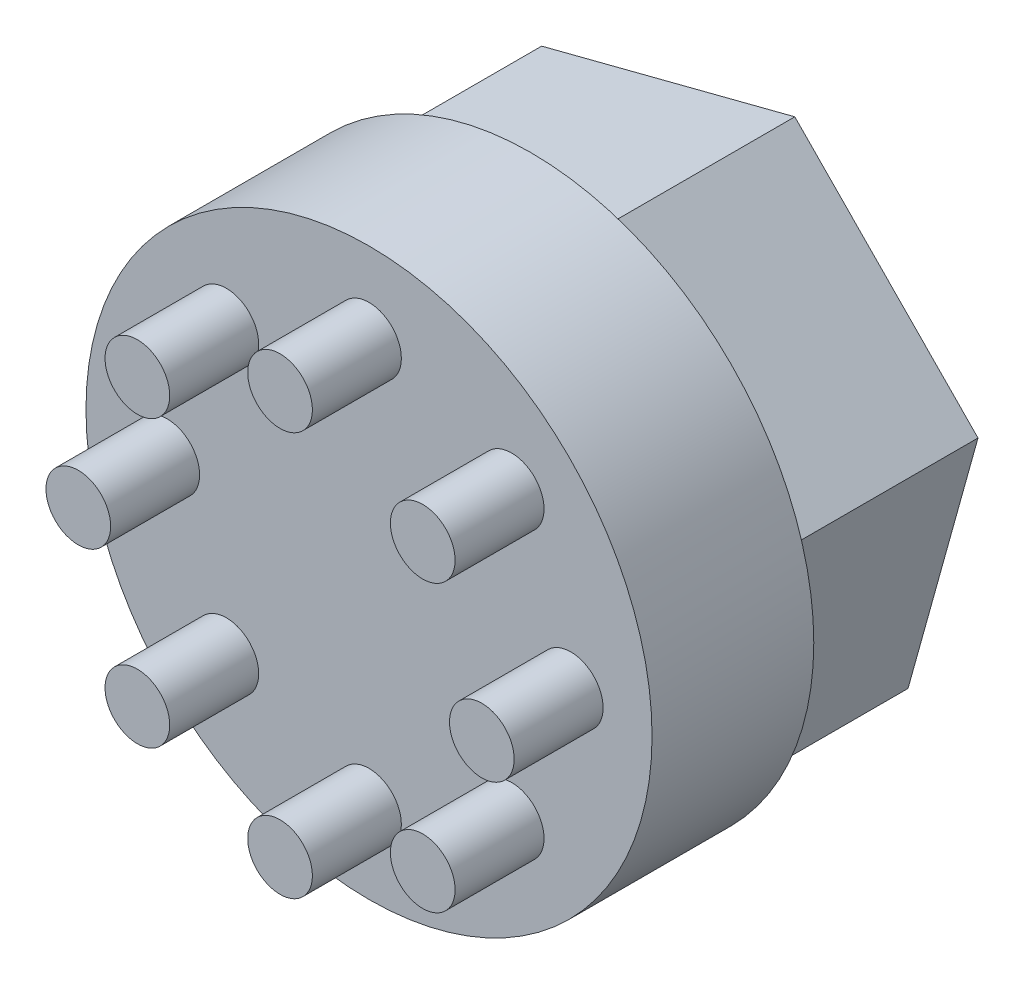
ISO-10303-21;
HEADER;
FILE_DESCRIPTION(('STEP AP214'),'2;1');
FILE_NAME('part.step','',(''),(''),'','','');
FILE_SCHEMA(('AUTOMOTIVE_DESIGN { 1 0 10303 214 1 1 1 1 }'));
ENDSEC;
DATA;
#1=APPLICATION_CONTEXT('core data for automotive mechanical design processes');
#2=APPLICATION_PROTOCOL_DEFINITION('international standard','automotive_design',2000,#1);
#3=PRODUCT_CONTEXT('',#1,'mechanical');
#4=PRODUCT('Part','Part','',(#3));
#5=PRODUCT_RELATED_PRODUCT_CATEGORY('part','',(#4));
#6=PRODUCT_DEFINITION_FORMATION('','',#4);
#7=PRODUCT_DEFINITION_CONTEXT('part definition',#1,'design');
#8=PRODUCT_DEFINITION('design','',#6,#7);
#9=PRODUCT_DEFINITION_SHAPE('','',#8);
#10=(LENGTH_UNIT() NAMED_UNIT(*) SI_UNIT(.MILLI.,.METRE.));
#11=(NAMED_UNIT(*) PLANE_ANGLE_UNIT() SI_UNIT($,.RADIAN.));
#12=(NAMED_UNIT(*) SI_UNIT($,.STERADIAN.) SOLID_ANGLE_UNIT());
#13=UNCERTAINTY_MEASURE_WITH_UNIT(LENGTH_MEASURE(1.E-05),#10,'distance_accuracy_value','');
#14=(GEOMETRIC_REPRESENTATION_CONTEXT(3) GLOBAL_UNCERTAINTY_ASSIGNED_CONTEXT((#13)) GLOBAL_UNIT_ASSIGNED_CONTEXT((#10,
#11,#12)) REPRESENTATION_CONTEXT('',''));
#15=CARTESIAN_POINT('',(0.,0.,0.));
#16=DIRECTION('',(0.,0.,1.));
#17=DIRECTION('',(1.,0.,0.));
#18=AXIS2_PLACEMENT_3D('',#15,#16,#17);
#19=CARTESIAN_POINT('',(0.,0.,0.));
#20=DIRECTION('',(0.,0.,1.));
#21=DIRECTION('',(1.,0.,0.));
#22=AXIS2_PLACEMENT_3D('',#19,#20,#21);
#23=PLANE('',#22);
#24=CARTESIAN_POINT('',(0.,0.,0.));
#25=DIRECTION('',(0.,0.,1.));
#26=DIRECTION('',(1.,0.,0.));
#27=AXIS2_PLACEMENT_3D('',#24,#25,#26);
#28=CIRCLE('',#27,17.5);
#29=CARTESIAN_POINT('',(17.5,0.,0.));
#30=VERTEX_POINT('',#29);
#31=EDGE_CURVE('E37',#30,#30,#28,.T.);
#32=ORIENTED_EDGE('',*,*,#31,.F.);
#33=EDGE_LOOP('',(#32));
#34=FACE_BOUND('',#33,.T.);
#35=DIRECTION('',(0.267671004992273,0.963510369994235,0.));
#36=VECTOR('',#35,1.);
#37=CARTESIAN_POINT('',(-15.6527041549309,-4.04056753087253,0.));
#38=LINE('',#37,#36);
#39=CARTESIAN_POINT('',(-15.6527041549309,-4.04056753087253,0.));
#40=VERTEX_POINT('',#39);
#41=CARTESIAN_POINT('',(-11.3255862049076,11.5353556706562,0.));
#42=VERTEX_POINT('',#41);
#43=EDGE_CURVE('E106',#40,#42,#38,.T.);
#44=ORIENTED_EDGE('',*,*,#43,.F.);
#45=DIRECTION('',(-0.700588954728615,0.713565075176936,0.));
#46=VECTOR('',#45,1.);
#47=CARTESIAN_POINT('',(-4.32711795002329,-15.5759232015287,0.));
#48=LINE('',#47,#46);
#49=CARTESIAN_POINT('',(-4.32711795002329,-15.5759232015287,0.));
#50=VERTEX_POINT('',#49);
#51=EDGE_CURVE('E103',#50,#40,#48,.T.);
#52=ORIENTED_EDGE('',*,*,#51,.F.);
#53=DIRECTION('',(-0.968259959720887,-0.249945294817298,0.));
#54=VECTOR('',#53,1.);
#55=CARTESIAN_POINT('',(11.3255862049076,-11.5353556706562,0.));
#56=LINE('',#55,#54);
#57=CARTESIAN_POINT('',(11.3255862049076,-11.5353556706562,0.));
#58=VERTEX_POINT('',#57);
#59=EDGE_CURVE('E185',#58,#50,#56,.T.);
#60=ORIENTED_EDGE('',*,*,#59,.F.);
#61=DIRECTION('',(-0.267671004992272,-0.963510369994235,0.));
#62=VECTOR('',#61,1.);
#63=CARTESIAN_POINT('',(15.6527041549309,4.04056753087254,0.));
#64=LINE('',#63,#62);
#65=CARTESIAN_POINT('',(15.6527041549309,4.04056753087254,0.));
#66=VERTEX_POINT('',#65);
#67=EDGE_CURVE('E202',#66,#58,#64,.T.);
#68=ORIENTED_EDGE('',*,*,#67,.F.);
#69=DIRECTION('',(0.700588954728615,-0.713565075176936,0.));
#70=VECTOR('',#69,1.);
#71=CARTESIAN_POINT('',(4.32711795002329,15.5759232015287,0.));
#72=LINE('',#71,#70);
#73=CARTESIAN_POINT('',(4.32711795002329,15.5759232015287,0.));
#74=VERTEX_POINT('',#73);
#75=EDGE_CURVE('E53',#74,#66,#72,.T.);
#76=ORIENTED_EDGE('',*,*,#75,.F.);
#77=DIRECTION('',(0.968259959720887,0.249945294817298,0.));
#78=VECTOR('',#77,1.);
#79=CARTESIAN_POINT('',(-11.3255862049076,11.5353556706562,0.));
#80=LINE('',#79,#78);
#81=EDGE_CURVE('E48',#42,#74,#80,.T.);
#82=ORIENTED_EDGE('',*,*,#81,.F.);
#83=EDGE_LOOP('',(#44,#52,#60,#68,#76,#82));
#84=FACE_BOUND('',#83,.T.);
#85=ADVANCED_FACE('F33',(#34,#84),#23,.F.);
#86=CARTESIAN_POINT('',(0.,0.,10.));
#87=DIRECTION('',(0.,0.,-1.));
#88=DIRECTION('',(-1.,0.,0.));
#89=AXIS2_PLACEMENT_3D('',#86,#87,#88);
#90=CYLINDRICAL_SURFACE('',#89,17.5);
#91=CARTESIAN_POINT('',(0.,0.,10.));
#92=DIRECTION('',(0.,0.,1.));
#93=DIRECTION('',(1.,0.,0.));
#94=AXIS2_PLACEMENT_3D('',#91,#92,#93);
#95=CIRCLE('',#94,17.5);
#96=CARTESIAN_POINT('',(17.5,0.,10.));
#97=VERTEX_POINT('',#96);
#98=EDGE_CURVE('E11',#97,#97,#95,.T.);
#99=ORIENTED_EDGE('',*,*,#98,.F.);
#100=EDGE_LOOP('',(#99));
#101=FACE_BOUND('',#100,.T.);
#102=ORIENTED_EDGE('',*,*,#31,.T.);
#103=EDGE_LOOP('',(#102));
#104=FACE_BOUND('',#103,.T.);
#105=ADVANCED_FACE('F35',(#101,#104),#90,.T.);
#106=CARTESIAN_POINT('',(0.,0.,10.));
#107=DIRECTION('',(0.,0.,1.));
#108=DIRECTION('',(1.,0.,0.));
#109=AXIS2_PLACEMENT_3D('',#106,#107,#108);
#110=PLANE('',#109);
#111=CARTESIAN_POINT('',(-8.82115709530209,8.82115709530196,10.));
#112=DIRECTION('',(0.,0.,1.));
#113=DIRECTION('',(1.,0.,0.));
#114=AXIS2_PLACEMENT_3D('',#111,#112,#113);
#115=CIRCLE('',#114,2.);
#116=CARTESIAN_POINT('',(-6.82115709530209,8.82115709530196,10.));
#117=VERTEX_POINT('',#116);
#118=EDGE_CURVE('E107',#117,#117,#115,.T.);
#119=ORIENTED_EDGE('',*,*,#118,.F.);
#120=EDGE_LOOP('',(#119));
#121=FACE_BOUND('',#120,.T.);
#122=CARTESIAN_POINT('',(-12.4749999999997,-3.10857854469547E-13,10.));
#123=DIRECTION('',(0.,0.,1.));
#124=DIRECTION('',(1.,0.,0.));
#125=AXIS2_PLACEMENT_3D('',#122,#123,#124);
#126=CIRCLE('',#125,2.);
#127=CARTESIAN_POINT('',(-10.4749999999997,-3.10857854469547E-13,10.));
#128=VERTEX_POINT('',#127);
#129=EDGE_CURVE('E117',#128,#128,#126,.T.);
#130=ORIENTED_EDGE('',*,*,#129,.F.);
#131=EDGE_LOOP('',(#130));
#132=FACE_BOUND('',#131,.T.);
#133=CARTESIAN_POINT('',(-8.82115709530165,-8.8211570953024,10.));
#134=DIRECTION('',(0.,0.,1.));
#135=DIRECTION('',(1.,0.,0.));
#136=AXIS2_PLACEMENT_3D('',#133,#134,#135);
#137=CIRCLE('',#136,2.);
#138=CARTESIAN_POINT('',(-6.82115709530165,-8.8211570953024,10.));
#139=VERTEX_POINT('',#138);
#140=EDGE_CURVE('E122',#139,#139,#137,.T.);
#141=ORIENTED_EDGE('',*,*,#140,.F.);
#142=EDGE_LOOP('',(#141));
#143=FACE_BOUND('',#142,.T.);
#144=CARTESIAN_POINT('',(6.18660215175221E-13,-12.475,10.));
#145=DIRECTION('',(0.,0.,1.));
#146=DIRECTION('',(1.,0.,0.));
#147=AXIS2_PLACEMENT_3D('',#144,#145,#146);
#148=CIRCLE('',#147,2.);
#149=CARTESIAN_POINT('',(2.00000000000062,-12.475,10.));
#150=VERTEX_POINT('',#149);
#151=EDGE_CURVE('E128',#150,#150,#148,.T.);
#152=ORIENTED_EDGE('',*,*,#151,.F.);
#153=EDGE_LOOP('',(#152));
#154=FACE_BOUND('',#153,.T.);
#155=CARTESIAN_POINT('',(8.82115709530271,-8.82115709530196,10.));
#156=DIRECTION('',(0.,0.,1.));
#157=DIRECTION('',(1.,0.,0.));
#158=AXIS2_PLACEMENT_3D('',#155,#156,#157);
#159=CIRCLE('',#158,2.);
#160=CARTESIAN_POINT('',(10.8211570953027,-8.82115709530196,10.));
#161=VERTEX_POINT('',#160);
#162=EDGE_CURVE('E134',#161,#161,#159,.T.);
#163=ORIENTED_EDGE('',*,*,#162,.F.);
#164=EDGE_LOOP('',(#163));
#165=FACE_BOUND('',#164,.T.);
#166=CARTESIAN_POINT('',(12.4750000000003,3.09330107587611E-13,10.));
#167=DIRECTION('',(0.,0.,1.));
#168=DIRECTION('',(1.,0.,0.));
#169=AXIS2_PLACEMENT_3D('',#166,#167,#168);
#170=CIRCLE('',#169,2.);
#171=CARTESIAN_POINT('',(14.4750000000003,3.09330107587611E-13,10.));
#172=VERTEX_POINT('',#171);
#173=EDGE_CURVE('E140',#172,#172,#170,.T.);
#174=ORIENTED_EDGE('',*,*,#173,.F.);
#175=EDGE_LOOP('',(#174));
#176=FACE_BOUND('',#175,.T.);
#177=CARTESIAN_POINT('',(8.82115709530227,8.8211570953024,10.));
#178=DIRECTION('',(0.,0.,1.));
#179=DIRECTION('',(1.,0.,0.));
#180=AXIS2_PLACEMENT_3D('',#177,#178,#179);
#181=CIRCLE('',#180,2.);
#182=CARTESIAN_POINT('',(10.8211570953023,8.8211570953024,10.));
#183=VERTEX_POINT('',#182);
#184=EDGE_CURVE('E146',#183,#183,#181,.T.);
#185=ORIENTED_EDGE('',*,*,#184,.F.);
#186=EDGE_LOOP('',(#185));
#187=FACE_BOUND('',#186,.T.);
#188=CARTESIAN_POINT('',(0.,12.475,10.));
#189=DIRECTION('',(0.,0.,1.));
#190=DIRECTION('',(1.,0.,0.));
#191=AXIS2_PLACEMENT_3D('',#188,#189,#190);
#192=CIRCLE('',#191,2.);
#193=CARTESIAN_POINT('',(2.,12.475,10.));
#194=VERTEX_POINT('',#193);
#195=EDGE_CURVE('E152',#194,#194,#192,.T.);
#196=ORIENTED_EDGE('',*,*,#195,.F.);
#197=EDGE_LOOP('',(#196));
#198=FACE_BOUND('',#197,.T.);
#199=ORIENTED_EDGE('',*,*,#98,.T.);
#200=EDGE_LOOP('',(#199));
#201=FACE_BOUND('',#200,.T.);
#202=ADVANCED_FACE('F163',(#121,#132,#143,#154,#165,#176,#187,#198,#201),#110,.T.);
#203=CARTESIAN_POINT('',(0.,12.475,15.5));
#204=DIRECTION('',(0.,0.,-1.));
#205=DIRECTION('',(-1.,0.,0.));
#206=AXIS2_PLACEMENT_3D('',#203,#204,#205);
#207=CYLINDRICAL_SURFACE('',#206,2.);
#208=CARTESIAN_POINT('',(0.,12.475,15.5));
#209=DIRECTION('',(0.,0.,1.));
#210=DIRECTION('',(1.,0.,0.));
#211=AXIS2_PLACEMENT_3D('',#208,#209,#210);
#212=CIRCLE('',#211,2.);
#213=CARTESIAN_POINT('',(2.,12.475,15.5));
#214=VERTEX_POINT('',#213);
#215=EDGE_CURVE('E155',#214,#214,#212,.T.);
#216=ORIENTED_EDGE('',*,*,#215,.F.);
#217=EDGE_LOOP('',(#216));
#218=FACE_BOUND('',#217,.T.);
#219=ORIENTED_EDGE('',*,*,#195,.T.);
#220=EDGE_LOOP('',(#219));
#221=FACE_BOUND('',#220,.T.);
#222=ADVANCED_FACE('F161',(#218,#221),#207,.T.);
#223=CARTESIAN_POINT('',(0.,12.475,15.5));
#224=DIRECTION('',(0.,0.,1.));
#225=DIRECTION('',(1.,0.,0.));
#226=AXIS2_PLACEMENT_3D('',#223,#224,#225);
#227=PLANE('',#226);
#228=ORIENTED_EDGE('',*,*,#215,.T.);
#229=EDGE_LOOP('',(#228));
#230=FACE_BOUND('',#229,.T.);
#231=ADVANCED_FACE('F286',(#230),#227,.T.);
#232=CARTESIAN_POINT('',(8.82115709530227,8.8211570953024,15.5));
#233=DIRECTION('',(0.,0.,-1.));
#234=DIRECTION('',(-1.,0.,0.));
#235=AXIS2_PLACEMENT_3D('',#232,#233,#234);
#236=CYLINDRICAL_SURFACE('',#235,2.);
#237=CARTESIAN_POINT('',(8.82115709530227,8.8211570953024,15.5));
#238=DIRECTION('',(0.,0.,1.));
#239=DIRECTION('',(1.,0.,0.));
#240=AXIS2_PLACEMENT_3D('',#237,#238,#239);
#241=CIRCLE('',#240,2.);
#242=CARTESIAN_POINT('',(10.8211570953023,8.8211570953024,15.5));
#243=VERTEX_POINT('',#242);
#244=EDGE_CURVE('E149',#243,#243,#241,.T.);
#245=ORIENTED_EDGE('',*,*,#244,.F.);
#246=EDGE_LOOP('',(#245));
#247=FACE_BOUND('',#246,.T.);
#248=ORIENTED_EDGE('',*,*,#184,.T.);
#249=EDGE_LOOP('',(#248));
#250=FACE_BOUND('',#249,.T.);
#251=ADVANCED_FACE('F282',(#247,#250),#236,.T.);
#252=CARTESIAN_POINT('',(8.82115709530227,8.8211570953024,15.5));
#253=DIRECTION('',(0.,0.,1.));
#254=DIRECTION('',(1.,0.,0.));
#255=AXIS2_PLACEMENT_3D('',#252,#253,#254);
#256=PLANE('',#255);
#257=ORIENTED_EDGE('',*,*,#244,.T.);
#258=EDGE_LOOP('',(#257));
#259=FACE_BOUND('',#258,.T.);
#260=ADVANCED_FACE('F278',(#259),#256,.T.);
#261=CARTESIAN_POINT('',(12.4750000000003,3.09330107587611E-13,15.5));
#262=DIRECTION('',(0.,0.,-1.));
#263=DIRECTION('',(-1.,0.,0.));
#264=AXIS2_PLACEMENT_3D('',#261,#262,#263);
#265=CYLINDRICAL_SURFACE('',#264,2.);
#266=CARTESIAN_POINT('',(12.4750000000003,3.09330107587611E-13,15.5));
#267=DIRECTION('',(0.,0.,1.));
#268=DIRECTION('',(1.,0.,0.));
#269=AXIS2_PLACEMENT_3D('',#266,#267,#268);
#270=CIRCLE('',#269,2.);
#271=CARTESIAN_POINT('',(14.4750000000003,3.09330107587611E-13,15.5));
#272=VERTEX_POINT('',#271);
#273=EDGE_CURVE('E143',#272,#272,#270,.T.);
#274=ORIENTED_EDGE('',*,*,#273,.F.);
#275=EDGE_LOOP('',(#274));
#276=FACE_BOUND('',#275,.T.);
#277=ORIENTED_EDGE('',*,*,#173,.T.);
#278=EDGE_LOOP('',(#277));
#279=FACE_BOUND('',#278,.T.);
#280=ADVANCED_FACE('F274',(#276,#279),#265,.T.);
#281=CARTESIAN_POINT('',(12.4750000000003,3.09330107587611E-13,15.5));
#282=DIRECTION('',(0.,0.,1.));
#283=DIRECTION('',(1.,0.,0.));
#284=AXIS2_PLACEMENT_3D('',#281,#282,#283);
#285=PLANE('',#284);
#286=ORIENTED_EDGE('',*,*,#273,.T.);
#287=EDGE_LOOP('',(#286));
#288=FACE_BOUND('',#287,.T.);
#289=ADVANCED_FACE('F270',(#288),#285,.T.);
#290=CARTESIAN_POINT('',(8.82115709530271,-8.82115709530196,15.5));
#291=DIRECTION('',(0.,0.,-1.));
#292=DIRECTION('',(-1.,0.,0.));
#293=AXIS2_PLACEMENT_3D('',#290,#291,#292);
#294=CYLINDRICAL_SURFACE('',#293,2.);
#295=CARTESIAN_POINT('',(8.82115709530271,-8.82115709530196,15.5));
#296=DIRECTION('',(0.,0.,1.));
#297=DIRECTION('',(1.,0.,0.));
#298=AXIS2_PLACEMENT_3D('',#295,#296,#297);
#299=CIRCLE('',#298,2.);
#300=CARTESIAN_POINT('',(10.8211570953027,-8.82115709530196,15.5));
#301=VERTEX_POINT('',#300);
#302=EDGE_CURVE('E137',#301,#301,#299,.T.);
#303=ORIENTED_EDGE('',*,*,#302,.F.);
#304=EDGE_LOOP('',(#303));
#305=FACE_BOUND('',#304,.T.);
#306=ORIENTED_EDGE('',*,*,#162,.T.);
#307=EDGE_LOOP('',(#306));
#308=FACE_BOUND('',#307,.T.);
#309=ADVANCED_FACE('F266',(#305,#308),#294,.T.);
#310=CARTESIAN_POINT('',(8.82115709530271,-8.82115709530196,15.5));
#311=DIRECTION('',(0.,0.,1.));
#312=DIRECTION('',(1.,0.,0.));
#313=AXIS2_PLACEMENT_3D('',#310,#311,#312);
#314=PLANE('',#313);
#315=ORIENTED_EDGE('',*,*,#302,.T.);
#316=EDGE_LOOP('',(#315));
#317=FACE_BOUND('',#316,.T.);
#318=ADVANCED_FACE('F262',(#317),#314,.T.);
#319=CARTESIAN_POINT('',(6.18660215175221E-13,-12.475,15.5));
#320=DIRECTION('',(0.,0.,-1.));
#321=DIRECTION('',(-1.,0.,0.));
#322=AXIS2_PLACEMENT_3D('',#319,#320,#321);
#323=CYLINDRICAL_SURFACE('',#322,2.);
#324=CARTESIAN_POINT('',(6.18660215175221E-13,-12.475,15.5));
#325=DIRECTION('',(0.,0.,1.));
#326=DIRECTION('',(1.,0.,0.));
#327=AXIS2_PLACEMENT_3D('',#324,#325,#326);
#328=CIRCLE('',#327,2.);
#329=CARTESIAN_POINT('',(2.00000000000062,-12.475,15.5));
#330=VERTEX_POINT('',#329);
#331=EDGE_CURVE('E131',#330,#330,#328,.T.);
#332=ORIENTED_EDGE('',*,*,#331,.F.);
#333=EDGE_LOOP('',(#332));
#334=FACE_BOUND('',#333,.T.);
#335=ORIENTED_EDGE('',*,*,#151,.T.);
#336=EDGE_LOOP('',(#335));
#337=FACE_BOUND('',#336,.T.);
#338=ADVANCED_FACE('F258',(#334,#337),#323,.T.);
#339=CARTESIAN_POINT('',(6.18660215175221E-13,-12.475,15.5));
#340=DIRECTION('',(0.,0.,1.));
#341=DIRECTION('',(1.,0.,0.));
#342=AXIS2_PLACEMENT_3D('',#339,#340,#341);
#343=PLANE('',#342);
#344=ORIENTED_EDGE('',*,*,#331,.T.);
#345=EDGE_LOOP('',(#344));
#346=FACE_BOUND('',#345,.T.);
#347=ADVANCED_FACE('F254',(#346),#343,.T.);
#348=CARTESIAN_POINT('',(-8.82115709530165,-8.8211570953024,15.5));
#349=DIRECTION('',(0.,0.,-1.));
#350=DIRECTION('',(-1.,0.,0.));
#351=AXIS2_PLACEMENT_3D('',#348,#349,#350);
#352=CYLINDRICAL_SURFACE('',#351,2.);
#353=CARTESIAN_POINT('',(-8.82115709530165,-8.8211570953024,15.5));
#354=DIRECTION('',(0.,0.,1.));
#355=DIRECTION('',(1.,0.,0.));
#356=AXIS2_PLACEMENT_3D('',#353,#354,#355);
#357=CIRCLE('',#356,2.);
#358=CARTESIAN_POINT('',(-6.82115709530165,-8.8211570953024,15.5));
#359=VERTEX_POINT('',#358);
#360=EDGE_CURVE('E125',#359,#359,#357,.T.);
#361=ORIENTED_EDGE('',*,*,#360,.F.);
#362=EDGE_LOOP('',(#361));
#363=FACE_BOUND('',#362,.T.);
#364=ORIENTED_EDGE('',*,*,#140,.T.);
#365=EDGE_LOOP('',(#364));
#366=FACE_BOUND('',#365,.T.);
#367=ADVANCED_FACE('F250',(#363,#366),#352,.T.);
#368=CARTESIAN_POINT('',(-8.82115709530165,-8.8211570953024,15.5));
#369=DIRECTION('',(0.,0.,1.));
#370=DIRECTION('',(1.,0.,0.));
#371=AXIS2_PLACEMENT_3D('',#368,#369,#370);
#372=PLANE('',#371);
#373=ORIENTED_EDGE('',*,*,#360,.T.);
#374=EDGE_LOOP('',(#373));
#375=FACE_BOUND('',#374,.T.);
#376=ADVANCED_FACE('F246',(#375),#372,.T.);
#377=CARTESIAN_POINT('',(-12.4749999999997,-3.10857854469547E-13,15.5));
#378=DIRECTION('',(0.,0.,-1.));
#379=DIRECTION('',(-1.,0.,0.));
#380=AXIS2_PLACEMENT_3D('',#377,#378,#379);
#381=CYLINDRICAL_SURFACE('',#380,2.);
#382=CARTESIAN_POINT('',(-12.4749999999997,-3.10857854469547E-13,15.5));
#383=DIRECTION('',(0.,0.,1.));
#384=DIRECTION('',(1.,0.,0.));
#385=AXIS2_PLACEMENT_3D('',#382,#383,#384);
#386=CIRCLE('',#385,2.);
#387=CARTESIAN_POINT('',(-10.4749999999997,-3.10857854469547E-13,15.5));
#388=VERTEX_POINT('',#387);
#389=EDGE_CURVE('E119',#388,#388,#386,.T.);
#390=ORIENTED_EDGE('',*,*,#389,.F.);
#391=EDGE_LOOP('',(#390));
#392=FACE_BOUND('',#391,.T.);
#393=ORIENTED_EDGE('',*,*,#129,.T.);
#394=EDGE_LOOP('',(#393));
#395=FACE_BOUND('',#394,.T.);
#396=ADVANCED_FACE('F242',(#392,#395),#381,.T.);
#397=CARTESIAN_POINT('',(-12.4749999999997,-3.10857854469547E-13,15.5));
#398=DIRECTION('',(0.,0.,1.));
#399=DIRECTION('',(1.,0.,0.));
#400=AXIS2_PLACEMENT_3D('',#397,#398,#399);
#401=PLANE('',#400);
#402=ORIENTED_EDGE('',*,*,#389,.T.);
#403=EDGE_LOOP('',(#402));
#404=FACE_BOUND('',#403,.T.);
#405=ADVANCED_FACE('F238',(#404),#401,.T.);
#406=CARTESIAN_POINT('',(-8.82115709530209,8.82115709530196,15.5));
#407=DIRECTION('',(0.,0.,-1.));
#408=DIRECTION('',(-1.,0.,0.));
#409=AXIS2_PLACEMENT_3D('',#406,#407,#408);
#410=CYLINDRICAL_SURFACE('',#409,2.);
#411=CARTESIAN_POINT('',(-8.82115709530209,8.82115709530196,15.5));
#412=DIRECTION('',(0.,0.,1.));
#413=DIRECTION('',(1.,0.,0.));
#414=AXIS2_PLACEMENT_3D('',#411,#412,#413);
#415=CIRCLE('',#414,2.);
#416=CARTESIAN_POINT('',(-6.82115709530209,8.82115709530196,15.5));
#417=VERTEX_POINT('',#416);
#418=EDGE_CURVE('E110',#417,#417,#415,.T.);
#419=ORIENTED_EDGE('',*,*,#418,.F.);
#420=EDGE_LOOP('',(#419));
#421=FACE_BOUND('',#420,.T.);
#422=ORIENTED_EDGE('',*,*,#118,.T.);
#423=EDGE_LOOP('',(#422));
#424=FACE_BOUND('',#423,.T.);
#425=ADVANCED_FACE('F234',(#421,#424),#410,.T.);
#426=CARTESIAN_POINT('',(-8.82115709530209,8.82115709530196,15.5));
#427=DIRECTION('',(0.,0.,1.));
#428=DIRECTION('',(1.,0.,0.));
#429=AXIS2_PLACEMENT_3D('',#426,#427,#428);
#430=PLANE('',#429);
#431=ORIENTED_EDGE('',*,*,#418,.T.);
#432=EDGE_LOOP('',(#431));
#433=FACE_BOUND('',#432,.T.);
#434=ADVANCED_FACE('F231',(#433),#430,.T.);
#435=CARTESIAN_POINT('',(-15.6527041549309,-4.04056753087253,-12.));
#436=DIRECTION('',(0.963510369994235,-0.267671004992273,0.));
#437=DIRECTION('',(0.267671004992273,0.963510369994235,0.));
#438=AXIS2_PLACEMENT_3D('',#435,#436,#437);
#439=PLANE('',#438);
#440=ORIENTED_EDGE('',*,*,#43,.T.);
#441=DIRECTION('',(0.,0.,1.));
#442=VECTOR('',#441,1.);
#443=CARTESIAN_POINT('',(-11.3255862049076,11.5353556706562,-12.));
#444=LINE('',#443,#442);
#445=CARTESIAN_POINT('',(-11.3255862049076,11.5353556706562,-12.));
#446=VERTEX_POINT('',#445);
#447=EDGE_CURVE('E87',#446,#42,#444,.T.);
#448=ORIENTED_EDGE('',*,*,#447,.F.);
#449=DIRECTION('',(0.267671004992273,0.963510369994235,0.));
#450=VECTOR('',#449,1.);
#451=CARTESIAN_POINT('',(-15.6527041549309,-4.04056753087253,-12.));
#452=LINE('',#451,#450);
#453=CARTESIAN_POINT('',(-15.6527041549309,-4.04056753087253,-12.));
#454=VERTEX_POINT('',#453);
#455=EDGE_CURVE('E94',#454,#446,#452,.T.);
#456=ORIENTED_EDGE('',*,*,#455,.F.);
#457=DIRECTION('',(0.,0.,1.));
#458=VECTOR('',#457,1.);
#459=CARTESIAN_POINT('',(-15.6527041549309,-4.04056753087253,-12.));
#460=LINE('',#459,#458);
#461=EDGE_CURVE('E182',#454,#40,#460,.T.);
#462=ORIENTED_EDGE('',*,*,#461,.T.);
#463=EDGE_LOOP('',(#440,#448,#456,#462));
#464=FACE_BOUND('',#463,.T.);
#465=ADVANCED_FACE('F105',(#464),#439,.F.);
#466=CARTESIAN_POINT('',(-11.3255862049076,11.5353556706562,-12.));
#467=DIRECTION('',(0.249945294817298,-0.968259959720887,0.));
#468=DIRECTION('',(0.968259959720887,0.249945294817298,0.));
#469=AXIS2_PLACEMENT_3D('',#466,#467,#468);
#470=PLANE('',#469);
#471=ORIENTED_EDGE('',*,*,#81,.T.);
#472=DIRECTION('',(0.,0.,1.));
#473=VECTOR('',#472,1.);
#474=CARTESIAN_POINT('',(4.32711795002329,15.5759232015287,-12.));
#475=LINE('',#474,#473);
#476=CARTESIAN_POINT('',(4.32711795002329,15.5759232015287,-12.));
#477=VERTEX_POINT('',#476);
#478=EDGE_CURVE('E90',#477,#74,#475,.T.);
#479=ORIENTED_EDGE('',*,*,#478,.F.);
#480=DIRECTION('',(0.968259959720887,0.249945294817298,0.));
#481=VECTOR('',#480,1.);
#482=CARTESIAN_POINT('',(-11.3255862049076,11.5353556706562,-12.));
#483=LINE('',#482,#481);
#484=EDGE_CURVE('E83',#446,#477,#483,.T.);
#485=ORIENTED_EDGE('',*,*,#484,.F.);
#486=ORIENTED_EDGE('',*,*,#447,.T.);
#487=EDGE_LOOP('',(#471,#479,#485,#486));
#488=FACE_BOUND('',#487,.T.);
#489=ADVANCED_FACE('F85',(#488),#470,.F.);
#490=CARTESIAN_POINT('',(4.32711795002329,15.5759232015287,-12.));
#491=DIRECTION('',(-0.713565075176936,-0.700588954728615,0.));
#492=DIRECTION('',(0.700588954728615,-0.713565075176936,0.));
#493=AXIS2_PLACEMENT_3D('',#490,#491,#492);
#494=PLANE('',#493);
#495=ORIENTED_EDGE('',*,*,#75,.T.);
#496=DIRECTION('',(0.,0.,1.));
#497=VECTOR('',#496,1.);
#498=CARTESIAN_POINT('',(15.6527041549309,4.04056753087254,-12.));
#499=LINE('',#498,#497);
#500=CARTESIAN_POINT('',(15.6527041549309,4.04056753087254,-12.));
#501=VERTEX_POINT('',#500);
#502=EDGE_CURVE('E112',#501,#66,#499,.T.);
#503=ORIENTED_EDGE('',*,*,#502,.F.);
#504=DIRECTION('',(0.700588954728615,-0.713565075176936,0.));
#505=VECTOR('',#504,1.);
#506=CARTESIAN_POINT('',(4.32711795002329,15.5759232015287,-12.));
#507=LINE('',#506,#505);
#508=EDGE_CURVE('E93',#477,#501,#507,.T.);
#509=ORIENTED_EDGE('',*,*,#508,.F.);
#510=ORIENTED_EDGE('',*,*,#478,.T.);
#511=EDGE_LOOP('',(#495,#503,#509,#510));
#512=FACE_BOUND('',#511,.T.);
#513=ADVANCED_FACE('F205',(#512),#494,.F.);
#514=CARTESIAN_POINT('',(15.6527041549309,4.04056753087254,-12.));
#515=DIRECTION('',(-0.963510369994235,0.267671004992272,0.));
#516=DIRECTION('',(-0.267671004992272,-0.963510369994235,0.));
#517=AXIS2_PLACEMENT_3D('',#514,#515,#516);
#518=PLANE('',#517);
#519=ORIENTED_EDGE('',*,*,#67,.T.);
#520=DIRECTION('',(0.,0.,1.));
#521=VECTOR('',#520,1.);
#522=CARTESIAN_POINT('',(11.3255862049076,-11.5353556706562,-12.));
#523=LINE('',#522,#521);
#524=CARTESIAN_POINT('',(11.3255862049076,-11.5353556706562,-12.));
#525=VERTEX_POINT('',#524);
#526=EDGE_CURVE('E188',#525,#58,#523,.T.);
#527=ORIENTED_EDGE('',*,*,#526,.F.);
#528=DIRECTION('',(-0.267671004992272,-0.963510369994235,0.));
#529=VECTOR('',#528,1.);
#530=CARTESIAN_POINT('',(15.6527041549309,4.04056753087254,-12.));
#531=LINE('',#530,#529);
#532=EDGE_CURVE('E203',#501,#525,#531,.T.);
#533=ORIENTED_EDGE('',*,*,#532,.F.);
#534=ORIENTED_EDGE('',*,*,#502,.T.);
#535=EDGE_LOOP('',(#519,#527,#533,#534));
#536=FACE_BOUND('',#535,.T.);
#537=ADVANCED_FACE('F200',(#536),#518,.F.);
#538=CARTESIAN_POINT('',(11.3255862049076,-11.5353556706562,-12.));
#539=DIRECTION('',(-0.249945294817298,0.968259959720887,0.));
#540=DIRECTION('',(-0.968259959720887,-0.249945294817298,0.));
#541=AXIS2_PLACEMENT_3D('',#538,#539,#540);
#542=PLANE('',#541);
#543=ORIENTED_EDGE('',*,*,#59,.T.);
#544=DIRECTION('',(0.,0.,1.));
#545=VECTOR('',#544,1.);
#546=CARTESIAN_POINT('',(-4.32711795002329,-15.5759232015287,-12.));
#547=LINE('',#546,#545);
#548=CARTESIAN_POINT('',(-4.32711795002329,-15.5759232015287,-12.));
#549=VERTEX_POINT('',#548);
#550=EDGE_CURVE('E184',#549,#50,#547,.T.);
#551=ORIENTED_EDGE('',*,*,#550,.F.);
#552=DIRECTION('',(-0.968259959720887,-0.249945294817298,0.));
#553=VECTOR('',#552,1.);
#554=CARTESIAN_POINT('',(11.3255862049076,-11.5353556706562,-12.));
#555=LINE('',#554,#553);
#556=EDGE_CURVE('E190',#525,#549,#555,.T.);
#557=ORIENTED_EDGE('',*,*,#556,.F.);
#558=ORIENTED_EDGE('',*,*,#526,.T.);
#559=EDGE_LOOP('',(#543,#551,#557,#558));
#560=FACE_BOUND('',#559,.T.);
#561=ADVANCED_FACE('F210',(#560),#542,.F.);
#562=CARTESIAN_POINT('',(-4.32711795002329,-15.5759232015287,-12.));
#563=DIRECTION('',(0.713565075176936,0.700588954728615,0.));
#564=DIRECTION('',(-0.700588954728615,0.713565075176936,0.));
#565=AXIS2_PLACEMENT_3D('',#562,#563,#564);
#566=PLANE('',#565);
#567=ORIENTED_EDGE('',*,*,#51,.T.);
#568=ORIENTED_EDGE('',*,*,#461,.F.);
#569=DIRECTION('',(-0.700588954728615,0.713565075176936,0.));
#570=VECTOR('',#569,1.);
#571=CARTESIAN_POINT('',(-4.32711795002329,-15.5759232015287,-12.));
#572=LINE('',#571,#570);
#573=EDGE_CURVE('E99',#549,#454,#572,.T.);
#574=ORIENTED_EDGE('',*,*,#573,.F.);
#575=ORIENTED_EDGE('',*,*,#550,.T.);
#576=EDGE_LOOP('',(#567,#568,#574,#575));
#577=FACE_BOUND('',#576,.T.);
#578=ADVANCED_FACE('F181',(#577),#566,.F.);
#579=CARTESIAN_POINT('',(0.,0.,-12.));
#580=DIRECTION('',(0.,0.,-1.));
#581=DIRECTION('',(-1.,0.,0.));
#582=AXIS2_PLACEMENT_3D('',#579,#580,#581);
#583=PLANE('',#582);
#584=ORIENTED_EDGE('',*,*,#455,.T.);
#585=ORIENTED_EDGE('',*,*,#484,.T.);
#586=ORIENTED_EDGE('',*,*,#508,.T.);
#587=ORIENTED_EDGE('',*,*,#532,.T.);
#588=ORIENTED_EDGE('',*,*,#556,.T.);
#589=ORIENTED_EDGE('',*,*,#573,.T.);
#590=EDGE_LOOP('',(#584,#585,#586,#587,#588,#589));
#591=FACE_BOUND('',#590,.T.);
#592=ADVANCED_FACE('F97',(#591),#583,.T.);
#593=CLOSED_SHELL('',(#85,#105,#202,#222,#231,#251,#260,#280,#289,#309,#318,#338,#347,#367,#376,
#396,#405,#425,#434,#465,#489,#513,#537,#561,#578,#592));
#594=MANIFOLD_SOLID_BREP('B2',#593);
#595=ADVANCED_BREP_SHAPE_REPRESENTATION('',(#18,#594),#14);
#596=SHAPE_DEFINITION_REPRESENTATION(#9,#595);
ENDSEC;
END-ISO-10303-21;
